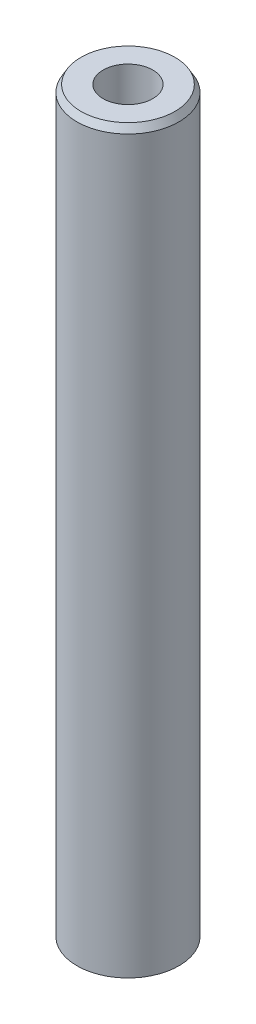
ISO-10303-21;
HEADER;
FILE_DESCRIPTION(('STEP AP214'),'2;1');
FILE_NAME('part.step','',(''),(''),'','','');
FILE_SCHEMA(('AUTOMOTIVE_DESIGN { 1 0 10303 214 1 1 1 1 }'));
ENDSEC;
DATA;
#1=APPLICATION_CONTEXT('core data for automotive mechanical design processes');
#2=APPLICATION_PROTOCOL_DEFINITION('international standard','automotive_design',2000,#1);
#3=PRODUCT_CONTEXT('',#1,'mechanical');
#4=PRODUCT('Part','Part','',(#3));
#5=PRODUCT_RELATED_PRODUCT_CATEGORY('part','',(#4));
#6=PRODUCT_DEFINITION_FORMATION('','',#4);
#7=PRODUCT_DEFINITION_CONTEXT('part definition',#1,'design');
#8=PRODUCT_DEFINITION('design','',#6,#7);
#9=PRODUCT_DEFINITION_SHAPE('','',#8);
#10=(LENGTH_UNIT() NAMED_UNIT(*) SI_UNIT(.MILLI.,.METRE.));
#11=(NAMED_UNIT(*) PLANE_ANGLE_UNIT() SI_UNIT($,.RADIAN.));
#12=(NAMED_UNIT(*) SI_UNIT($,.STERADIAN.) SOLID_ANGLE_UNIT());
#13=UNCERTAINTY_MEASURE_WITH_UNIT(LENGTH_MEASURE(1.E-05),#10,'distance_accuracy_value','');
#14=(GEOMETRIC_REPRESENTATION_CONTEXT(3) GLOBAL_UNCERTAINTY_ASSIGNED_CONTEXT((#13)) GLOBAL_UNIT_ASSIGNED_CONTEXT((#10,
#11,#12)) REPRESENTATION_CONTEXT('',''));
#15=CARTESIAN_POINT('',(0.,0.,0.));
#16=DIRECTION('',(0.,0.,1.));
#17=DIRECTION('',(1.,0.,0.));
#18=AXIS2_PLACEMENT_3D('',#15,#16,#17);
#19=CARTESIAN_POINT('',(0.,109.103731087847,0.));
#20=DIRECTION('',(0.,-1.,0.));
#21=DIRECTION('',(0.,0.,-1.));
#22=AXIS2_PLACEMENT_3D('',#19,#20,#21);
#23=CYLINDRICAL_SURFACE('',#22,7.5);
#24=CARTESIAN_POINT('',(0.,108.071193491132,0.));
#25=DIRECTION('',(0.,1.,0.));
#26=DIRECTION('',(0.,0.,1.));
#27=AXIS2_PLACEMENT_3D('',#24,#25,#26);
#28=CIRCLE('',#27,7.5);
#29=CARTESIAN_POINT('',(0.,108.071193491132,7.5));
#30=VERTEX_POINT('',#29);
#31=EDGE_CURVE('E50',#30,#30,#28,.F.);
#32=ORIENTED_EDGE('',*,*,#31,.T.);
#33=EDGE_LOOP('',(#32));
#34=FACE_BOUND('',#33,.T.);
#35=CARTESIAN_POINT('',(0.,0.596135859411637,0.));
#36=DIRECTION('',(0.,1.,0.));
#37=DIRECTION('',(0.,0.,1.));
#38=AXIS2_PLACEMENT_3D('',#35,#36,#37);
#39=CIRCLE('',#38,7.5);
#40=CARTESIAN_POINT('',(0.,0.596135859411637,7.5));
#41=VERTEX_POINT('',#40);
#42=EDGE_CURVE('E51',#41,#41,#39,.T.);
#43=ORIENTED_EDGE('',*,*,#42,.T.);
#44=EDGE_LOOP('',(#43));
#45=FACE_BOUND('',#44,.T.);
#46=ADVANCED_FACE('F39',(#34,#45),#23,.T.);
#47=CARTESIAN_POINT('',(0.,109.103731087847,0.));
#48=DIRECTION('',(0.,1.,0.));
#49=DIRECTION('',(0.,0.,1.));
#50=AXIS2_PLACEMENT_3D('',#47,#48,#49);
#51=PLANE('',#50);
#52=CARTESIAN_POINT('',(0.,109.103731087847,0.));
#53=DIRECTION('',(0.,1.,0.));
#54=DIRECTION('',(0.,0.,1.));
#55=AXIS2_PLACEMENT_3D('',#52,#53,#54);
#56=CIRCLE('',#55,6.90386414058833);
#57=CARTESIAN_POINT('',(0.,109.103731087847,6.90386414058833));
#58=VERTEX_POINT('',#57);
#59=EDGE_CURVE('E54',#58,#58,#56,.T.);
#60=ORIENTED_EDGE('',*,*,#59,.T.);
#61=EDGE_LOOP('',(#60));
#62=FACE_BOUND('',#61,.T.);
#63=CARTESIAN_POINT('',(0.,109.103731087847,0.));
#64=DIRECTION('',(0.,1.,0.));
#65=DIRECTION('',(0.,0.,1.));
#66=AXIS2_PLACEMENT_3D('',#63,#64,#65);
#67=CIRCLE('',#66,3.6534366336367);
#68=CARTESIAN_POINT('',(0.,109.103731087847,3.6534366336367));
#69=VERTEX_POINT('',#68);
#70=EDGE_CURVE('E58',#69,#69,#67,.T.);
#71=ORIENTED_EDGE('',*,*,#70,.F.);
#72=EDGE_LOOP('',(#71));
#73=FACE_BOUND('',#72,.T.);
#74=ADVANCED_FACE('F69',(#62,#73),#51,.T.);
#75=CARTESIAN_POINT('',(0.,0.,0.));
#76=DIRECTION('',(0.,1.,0.));
#77=DIRECTION('',(0.,0.,1.));
#78=AXIS2_PLACEMENT_3D('',#75,#76,#77);
#79=PLANE('',#78);
#80=CARTESIAN_POINT('',(0.,0.,0.));
#81=DIRECTION('',(0.,1.,0.));
#82=DIRECTION('',(0.,0.,1.));
#83=AXIS2_PLACEMENT_3D('',#80,#81,#82);
#84=CIRCLE('',#83,6.46746240328529);
#85=CARTESIAN_POINT('',(0.,0.,6.46746240328529));
#86=VERTEX_POINT('',#85);
#87=EDGE_CURVE('E10',#86,#86,#84,.F.);
#88=ORIENTED_EDGE('',*,*,#87,.T.);
#89=EDGE_LOOP('',(#88));
#90=FACE_BOUND('',#89,.T.);
#91=CARTESIAN_POINT('',(0.,0.,0.));
#92=DIRECTION('',(0.,1.,0.));
#93=DIRECTION('',(0.,0.,1.));
#94=AXIS2_PLACEMENT_3D('',#91,#92,#93);
#95=CIRCLE('',#94,3.6534366336367);
#96=CARTESIAN_POINT('',(0.,0.,3.6534366336367));
#97=VERTEX_POINT('',#96);
#98=EDGE_CURVE('E63',#97,#97,#95,.T.);
#99=ORIENTED_EDGE('',*,*,#98,.T.);
#100=EDGE_LOOP('',(#99));
#101=FACE_BOUND('',#100,.T.);
#102=ADVANCED_FACE('F75',(#90,#101),#79,.F.);
#103=CARTESIAN_POINT('',(0.,109.103731087847,0.));
#104=DIRECTION('',(0.,-1.,0.));
#105=DIRECTION('',(0.,0.,-1.));
#106=AXIS2_PLACEMENT_3D('',#103,#104,#105);
#107=CYLINDRICAL_SURFACE('',#106,3.6534366336367);
#108=ORIENTED_EDGE('',*,*,#70,.T.);
#109=EDGE_LOOP('',(#108));
#110=FACE_BOUND('',#109,.T.);
#111=ORIENTED_EDGE('',*,*,#98,.F.);
#112=EDGE_LOOP('',(#111));
#113=FACE_BOUND('',#112,.T.);
#114=ADVANCED_FACE('F70',(#110,#113),#107,.F.);
#115=CARTESIAN_POINT('',(0.,109.103731087847,0.));
#116=DIRECTION('',(0.,-1.,0.));
#117=DIRECTION('',(0.,0.,-1.));
#118=AXIS2_PLACEMENT_3D('',#115,#116,#117);
#119=CONICAL_SURFACE('',#118,6.90386414058833,0.523598775598295);
#120=ORIENTED_EDGE('',*,*,#31,.F.);
#121=EDGE_LOOP('',(#120));
#122=FACE_BOUND('',#121,.T.);
#123=ORIENTED_EDGE('',*,*,#59,.F.);
#124=EDGE_LOOP('',(#123));
#125=FACE_BOUND('',#124,.T.);
#126=ADVANCED_FACE('F81',(#122,#125),#119,.T.);
#127=CARTESIAN_POINT('',(0.,0.596135859411637,0.));
#128=DIRECTION('',(0.,1.,0.));
#129=DIRECTION('',(0.,0.,1.));
#130=AXIS2_PLACEMENT_3D('',#127,#128,#129);
#131=CONICAL_SURFACE('',#130,7.5,1.04719755119661);
#132=ORIENTED_EDGE('',*,*,#87,.F.);
#133=EDGE_LOOP('',(#132));
#134=FACE_BOUND('',#133,.T.);
#135=ORIENTED_EDGE('',*,*,#42,.F.);
#136=EDGE_LOOP('',(#135));
#137=FACE_BOUND('',#136,.T.);
#138=ADVANCED_FACE('F45',(#134,#137),#131,.T.);
#139=CLOSED_SHELL('',(#46,#74,#102,#114,#126,#138));
#140=MANIFOLD_SOLID_BREP('B2',#139);
#141=ADVANCED_BREP_SHAPE_REPRESENTATION('',(#18,#140),#14);
#142=SHAPE_DEFINITION_REPRESENTATION(#9,#141);
ENDSEC;
END-ISO-10303-21;
